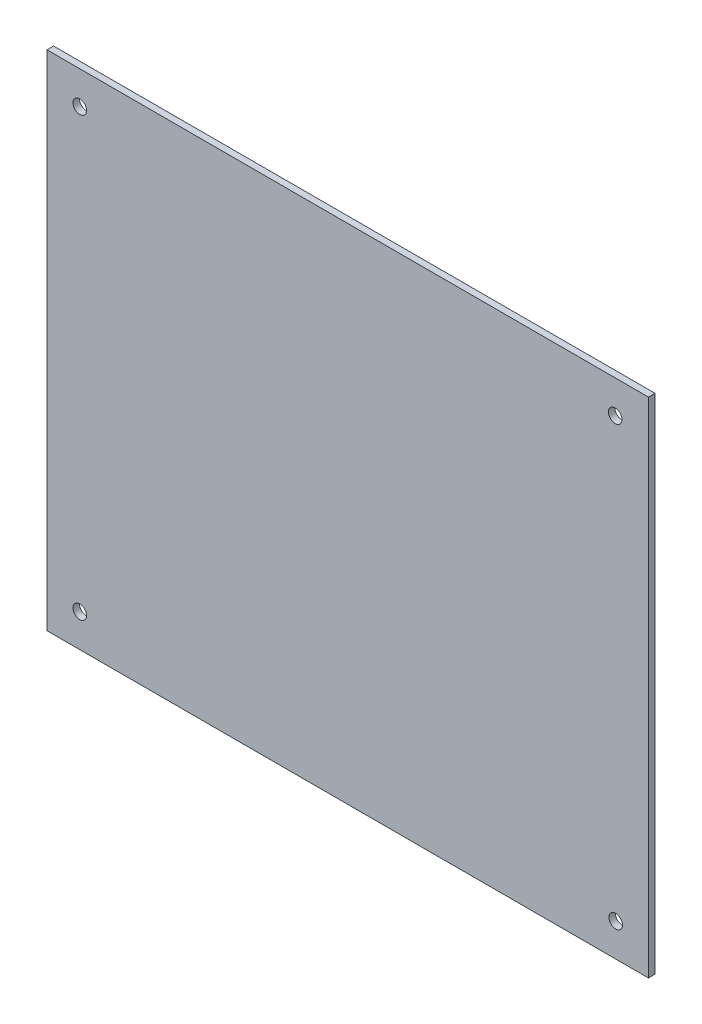
ISO-10303-21;
HEADER;
FILE_DESCRIPTION(('STEP AP214'),'2;1');
FILE_NAME('part.step','',(''),(''),'','','');
FILE_SCHEMA(('AUTOMOTIVE_DESIGN { 1 0 10303 214 1 1 1 1 }'));
ENDSEC;
DATA;
#1=APPLICATION_CONTEXT('core data for automotive mechanical design processes');
#2=APPLICATION_PROTOCOL_DEFINITION('international standard','automotive_design',2000,#1);
#3=PRODUCT_CONTEXT('',#1,'mechanical');
#4=PRODUCT('Part','Part','',(#3));
#5=PRODUCT_RELATED_PRODUCT_CATEGORY('part','',(#4));
#6=PRODUCT_DEFINITION_FORMATION('','',#4);
#7=PRODUCT_DEFINITION_CONTEXT('part definition',#1,'design');
#8=PRODUCT_DEFINITION('design','',#6,#7);
#9=PRODUCT_DEFINITION_SHAPE('','',#8);
#10=(LENGTH_UNIT() NAMED_UNIT(*) SI_UNIT(.MILLI.,.METRE.));
#11=(NAMED_UNIT(*) PLANE_ANGLE_UNIT() SI_UNIT($,.RADIAN.));
#12=(NAMED_UNIT(*) SI_UNIT($,.STERADIAN.) SOLID_ANGLE_UNIT());
#13=UNCERTAINTY_MEASURE_WITH_UNIT(LENGTH_MEASURE(1.E-05),#10,'distance_accuracy_value','');
#14=(GEOMETRIC_REPRESENTATION_CONTEXT(3) GLOBAL_UNCERTAINTY_ASSIGNED_CONTEXT((#13)) GLOBAL_UNIT_ASSIGNED_CONTEXT((#10,
#11,#12)) REPRESENTATION_CONTEXT('',''));
#15=CARTESIAN_POINT('',(0.,0.,0.));
#16=DIRECTION('',(0.,0.,1.));
#17=DIRECTION('',(1.,0.,0.));
#18=AXIS2_PLACEMENT_3D('',#15,#16,#17);
#19=CARTESIAN_POINT('',(0.,0.,3.));
#20=DIRECTION('',(0.,0.,1.));
#21=DIRECTION('',(1.,0.,0.));
#22=AXIS2_PLACEMENT_3D('',#19,#20,#21);
#23=PLANE('',#22);
#24=CARTESIAN_POINT('',(-122.5,-100.,3.));
#25=DIRECTION('',(0.,0.,1.));
#26=DIRECTION('',(1.,0.,0.));
#27=AXIS2_PLACEMENT_3D('',#24,#25,#26);
#28=CIRCLE('',#27,3.1);
#29=CARTESIAN_POINT('',(-119.4,-100.,3.));
#30=VERTEX_POINT('',#29);
#31=EDGE_CURVE('E121',#30,#30,#28,.T.);
#32=ORIENTED_EDGE('',*,*,#31,.F.);
#33=EDGE_LOOP('',(#32));
#34=FACE_BOUND('',#33,.T.);
#35=CARTESIAN_POINT('',(-122.5,100.,3.));
#36=DIRECTION('',(0.,0.,1.));
#37=DIRECTION('',(1.,0.,0.));
#38=AXIS2_PLACEMENT_3D('',#35,#36,#37);
#39=CIRCLE('',#38,3.1);
#40=CARTESIAN_POINT('',(-119.4,100.,3.));
#41=VERTEX_POINT('',#40);
#42=EDGE_CURVE('E100',#41,#41,#39,.T.);
#43=ORIENTED_EDGE('',*,*,#42,.F.);
#44=EDGE_LOOP('',(#43));
#45=FACE_BOUND('',#44,.T.);
#46=DIRECTION('',(0.,1.,0.));
#47=VECTOR('',#46,1.);
#48=CARTESIAN_POINT('',(137.5,115.,3.));
#49=LINE('',#48,#47);
#50=CARTESIAN_POINT('',(137.5,-115.,3.));
#51=VERTEX_POINT('',#50);
#52=CARTESIAN_POINT('',(137.5,115.,3.));
#53=VERTEX_POINT('',#52);
#54=EDGE_CURVE('E85',#51,#53,#49,.T.);
#55=ORIENTED_EDGE('',*,*,#54,.T.);
#56=DIRECTION('',(-1.,0.,0.));
#57=VECTOR('',#56,1.);
#58=CARTESIAN_POINT('',(-137.5,115.,3.));
#59=LINE('',#58,#57);
#60=CARTESIAN_POINT('',(-137.5,115.,3.));
#61=VERTEX_POINT('',#60);
#62=EDGE_CURVE('E80',#53,#61,#59,.T.);
#63=ORIENTED_EDGE('',*,*,#62,.T.);
#64=DIRECTION('',(0.,-1.,0.));
#65=VECTOR('',#64,1.);
#66=CARTESIAN_POINT('',(-137.5,115.,3.));
#67=LINE('',#66,#65);
#68=CARTESIAN_POINT('',(-137.5,-115.,3.));
#69=VERTEX_POINT('',#68);
#70=EDGE_CURVE('E83',#61,#69,#67,.T.);
#71=ORIENTED_EDGE('',*,*,#70,.T.);
#72=DIRECTION('',(1.,0.,0.));
#73=VECTOR('',#72,1.);
#74=CARTESIAN_POINT('',(-137.5,-115.,3.));
#75=LINE('',#74,#73);
#76=EDGE_CURVE('E50',#69,#51,#75,.T.);
#77=ORIENTED_EDGE('',*,*,#76,.T.);
#78=EDGE_LOOP('',(#55,#63,#71,#77));
#79=FACE_BOUND('',#78,.T.);
#80=CARTESIAN_POINT('',(122.275174874517,100.,3.));
#81=DIRECTION('',(0.,0.,1.));
#82=DIRECTION('',(1.,0.,0.));
#83=AXIS2_PLACEMENT_3D('',#80,#81,#82);
#84=CIRCLE('',#83,3.09999999999999);
#85=CARTESIAN_POINT('',(125.375174874517,100.,3.));
#86=VERTEX_POINT('',#85);
#87=EDGE_CURVE('E115',#86,#86,#84,.T.);
#88=ORIENTED_EDGE('',*,*,#87,.F.);
#89=EDGE_LOOP('',(#88));
#90=FACE_BOUND('',#89,.T.);
#91=CARTESIAN_POINT('',(122.500000000001,-99.9999999999971,3.));
#92=DIRECTION('',(0.,0.,1.));
#93=DIRECTION('',(1.,0.,0.));
#94=AXIS2_PLACEMENT_3D('',#91,#92,#93);
#95=CIRCLE('',#94,3.09999999999999);
#96=CARTESIAN_POINT('',(125.600000000001,-99.9999999999971,3.));
#97=VERTEX_POINT('',#96);
#98=EDGE_CURVE('E127',#97,#97,#95,.T.);
#99=ORIENTED_EDGE('',*,*,#98,.F.);
#100=EDGE_LOOP('',(#99));
#101=FACE_BOUND('',#100,.T.);
#102=ADVANCED_FACE('F33',(#34,#45,#79,#90,#101),#23,.T.);
#103=CARTESIAN_POINT('',(0.,0.,0.));
#104=DIRECTION('',(0.,0.,1.));
#105=DIRECTION('',(1.,0.,0.));
#106=AXIS2_PLACEMENT_3D('',#103,#104,#105);
#107=PLANE('',#106);
#108=DIRECTION('',(0.,1.,0.));
#109=VECTOR('',#108,1.);
#110=CARTESIAN_POINT('',(137.5,115.,0.));
#111=LINE('',#110,#109);
#112=CARTESIAN_POINT('',(137.5,-115.,0.));
#113=VERTEX_POINT('',#112);
#114=CARTESIAN_POINT('',(137.5,115.,0.));
#115=VERTEX_POINT('',#114);
#116=EDGE_CURVE('E97',#113,#115,#111,.T.);
#117=ORIENTED_EDGE('',*,*,#116,.F.);
#118=DIRECTION('',(1.,0.,0.));
#119=VECTOR('',#118,1.);
#120=CARTESIAN_POINT('',(-137.5,-115.,0.));
#121=LINE('',#120,#119);
#122=CARTESIAN_POINT('',(-137.5,-115.,0.));
#123=VERTEX_POINT('',#122);
#124=EDGE_CURVE('E73',#123,#113,#121,.T.);
#125=ORIENTED_EDGE('',*,*,#124,.F.);
#126=DIRECTION('',(0.,-1.,0.));
#127=VECTOR('',#126,1.);
#128=CARTESIAN_POINT('',(-137.5,115.,0.));
#129=LINE('',#128,#127);
#130=CARTESIAN_POINT('',(-137.5,115.,0.));
#131=VERTEX_POINT('',#130);
#132=EDGE_CURVE('E67',#131,#123,#129,.T.);
#133=ORIENTED_EDGE('',*,*,#132,.F.);
#134=DIRECTION('',(-1.,0.,0.));
#135=VECTOR('',#134,1.);
#136=CARTESIAN_POINT('',(-137.5,115.,0.));
#137=LINE('',#136,#135);
#138=EDGE_CURVE('E89',#115,#131,#137,.T.);
#139=ORIENTED_EDGE('',*,*,#138,.F.);
#140=EDGE_LOOP('',(#117,#125,#133,#139));
#141=FACE_BOUND('',#140,.T.);
#142=CARTESIAN_POINT('',(-122.5,100.,0.));
#143=DIRECTION('',(0.,0.,1.));
#144=DIRECTION('',(1.,0.,0.));
#145=AXIS2_PLACEMENT_3D('',#142,#143,#144);
#146=CIRCLE('',#145,3.1);
#147=CARTESIAN_POINT('',(-119.4,100.,0.));
#148=VERTEX_POINT('',#147);
#149=EDGE_CURVE('E112',#148,#148,#146,.T.);
#150=ORIENTED_EDGE('',*,*,#149,.T.);
#151=EDGE_LOOP('',(#150));
#152=FACE_BOUND('',#151,.T.);
#153=CARTESIAN_POINT('',(122.275174874517,100.,0.));
#154=DIRECTION('',(0.,0.,1.));
#155=DIRECTION('',(1.,0.,0.));
#156=AXIS2_PLACEMENT_3D('',#153,#154,#155);
#157=CIRCLE('',#156,3.09999999999999);
#158=CARTESIAN_POINT('',(125.375174874517,100.,0.));
#159=VERTEX_POINT('',#158);
#160=EDGE_CURVE('E118',#159,#159,#157,.T.);
#161=ORIENTED_EDGE('',*,*,#160,.T.);
#162=EDGE_LOOP('',(#161));
#163=FACE_BOUND('',#162,.T.);
#164=CARTESIAN_POINT('',(-122.5,-100.,0.));
#165=DIRECTION('',(0.,0.,1.));
#166=DIRECTION('',(1.,0.,0.));
#167=AXIS2_PLACEMENT_3D('',#164,#165,#166);
#168=CIRCLE('',#167,3.1);
#169=CARTESIAN_POINT('',(-119.4,-100.,0.));
#170=VERTEX_POINT('',#169);
#171=EDGE_CURVE('E124',#170,#170,#168,.T.);
#172=ORIENTED_EDGE('',*,*,#171,.T.);
#173=EDGE_LOOP('',(#172));
#174=FACE_BOUND('',#173,.T.);
#175=CARTESIAN_POINT('',(122.500000000001,-99.9999999999971,0.));
#176=DIRECTION('',(0.,0.,1.));
#177=DIRECTION('',(1.,0.,0.));
#178=AXIS2_PLACEMENT_3D('',#175,#176,#177);
#179=CIRCLE('',#178,3.09999999999999);
#180=CARTESIAN_POINT('',(125.600000000001,-99.9999999999971,0.));
#181=VERTEX_POINT('',#180);
#182=EDGE_CURVE('E130',#181,#181,#179,.T.);
#183=ORIENTED_EDGE('',*,*,#182,.T.);
#184=EDGE_LOOP('',(#183));
#185=FACE_BOUND('',#184,.T.);
#186=ADVANCED_FACE('F108',(#141,#152,#163,#174,#185),#107,.F.);
#187=CARTESIAN_POINT('',(137.5,115.,3.));
#188=DIRECTION('',(-1.,0.,0.));
#189=DIRECTION('',(0.,-1.,0.));
#190=AXIS2_PLACEMENT_3D('',#187,#188,#189);
#191=PLANE('',#190);
#192=ORIENTED_EDGE('',*,*,#116,.T.);
#193=DIRECTION('',(0.,0.,-1.));
#194=VECTOR('',#193,1.);
#195=CARTESIAN_POINT('',(137.5,115.,3.));
#196=LINE('',#195,#194);
#197=EDGE_CURVE('E11',#53,#115,#196,.T.);
#198=ORIENTED_EDGE('',*,*,#197,.F.);
#199=ORIENTED_EDGE('',*,*,#54,.F.);
#200=DIRECTION('',(0.,0.,-1.));
#201=VECTOR('',#200,1.);
#202=CARTESIAN_POINT('',(137.5,-115.,3.));
#203=LINE('',#202,#201);
#204=EDGE_CURVE('E93',#51,#113,#203,.T.);
#205=ORIENTED_EDGE('',*,*,#204,.T.);
#206=EDGE_LOOP('',(#192,#198,#199,#205));
#207=FACE_BOUND('',#206,.T.);
#208=ADVANCED_FACE('F35',(#207),#191,.F.);
#209=CARTESIAN_POINT('',(-137.5,115.,3.));
#210=DIRECTION('',(0.,-1.,0.));
#211=DIRECTION('',(0.,0.,-1.));
#212=AXIS2_PLACEMENT_3D('',#209,#210,#211);
#213=PLANE('',#212);
#214=ORIENTED_EDGE('',*,*,#138,.T.);
#215=DIRECTION('',(0.,0.,-1.));
#216=VECTOR('',#215,1.);
#217=CARTESIAN_POINT('',(-137.5,115.,3.));
#218=LINE('',#217,#216);
#219=EDGE_CURVE('E42',#61,#131,#218,.T.);
#220=ORIENTED_EDGE('',*,*,#219,.F.);
#221=ORIENTED_EDGE('',*,*,#62,.F.);
#222=ORIENTED_EDGE('',*,*,#197,.T.);
#223=EDGE_LOOP('',(#214,#220,#221,#222));
#224=FACE_BOUND('',#223,.T.);
#225=ADVANCED_FACE('F88',(#224),#213,.F.);
#226=CARTESIAN_POINT('',(-137.5,115.,3.));
#227=DIRECTION('',(1.,0.,0.));
#228=DIRECTION('',(0.,1.,0.));
#229=AXIS2_PLACEMENT_3D('',#226,#227,#228);
#230=PLANE('',#229);
#231=ORIENTED_EDGE('',*,*,#132,.T.);
#232=DIRECTION('',(0.,0.,-1.));
#233=VECTOR('',#232,1.);
#234=CARTESIAN_POINT('',(-137.5,-115.,3.));
#235=LINE('',#234,#233);
#236=EDGE_CURVE('E90',#69,#123,#235,.T.);
#237=ORIENTED_EDGE('',*,*,#236,.F.);
#238=ORIENTED_EDGE('',*,*,#70,.F.);
#239=ORIENTED_EDGE('',*,*,#219,.T.);
#240=EDGE_LOOP('',(#231,#237,#238,#239));
#241=FACE_BOUND('',#240,.T.);
#242=ADVANCED_FACE('F91',(#241),#230,.F.);
#243=CARTESIAN_POINT('',(-137.5,-115.,3.));
#244=DIRECTION('',(0.,1.,0.));
#245=DIRECTION('',(0.,0.,1.));
#246=AXIS2_PLACEMENT_3D('',#243,#244,#245);
#247=PLANE('',#246);
#248=ORIENTED_EDGE('',*,*,#124,.T.);
#249=ORIENTED_EDGE('',*,*,#204,.F.);
#250=ORIENTED_EDGE('',*,*,#76,.F.);
#251=ORIENTED_EDGE('',*,*,#236,.T.);
#252=EDGE_LOOP('',(#248,#249,#250,#251));
#253=FACE_BOUND('',#252,.T.);
#254=ADVANCED_FACE('F105',(#253),#247,.F.);
#255=CARTESIAN_POINT('',(-122.5,100.,3.));
#256=DIRECTION('',(0.,0.,-1.));
#257=DIRECTION('',(-1.,0.,0.));
#258=AXIS2_PLACEMENT_3D('',#255,#256,#257);
#259=CYLINDRICAL_SURFACE('',#258,3.1);
#260=ORIENTED_EDGE('',*,*,#42,.T.);
#261=EDGE_LOOP('',(#260));
#262=FACE_BOUND('',#261,.T.);
#263=ORIENTED_EDGE('',*,*,#149,.F.);
#264=EDGE_LOOP('',(#263));
#265=FACE_BOUND('',#264,.T.);
#266=ADVANCED_FACE('F149',(#262,#265),#259,.F.);
#267=CARTESIAN_POINT('',(122.275174874517,100.,3.));
#268=DIRECTION('',(0.,0.,-1.));
#269=DIRECTION('',(-1.,0.,0.));
#270=AXIS2_PLACEMENT_3D('',#267,#268,#269);
#271=CYLINDRICAL_SURFACE('',#270,3.09999999999999);
#272=ORIENTED_EDGE('',*,*,#87,.T.);
#273=EDGE_LOOP('',(#272));
#274=FACE_BOUND('',#273,.T.);
#275=ORIENTED_EDGE('',*,*,#160,.F.);
#276=EDGE_LOOP('',(#275));
#277=FACE_BOUND('',#276,.T.);
#278=ADVANCED_FACE('F195',(#274,#277),#271,.F.);
#279=CARTESIAN_POINT('',(-122.5,-100.,3.));
#280=DIRECTION('',(0.,0.,-1.));
#281=DIRECTION('',(-1.,0.,0.));
#282=AXIS2_PLACEMENT_3D('',#279,#280,#281);
#283=CYLINDRICAL_SURFACE('',#282,3.1);
#284=ORIENTED_EDGE('',*,*,#31,.T.);
#285=EDGE_LOOP('',(#284));
#286=FACE_BOUND('',#285,.T.);
#287=ORIENTED_EDGE('',*,*,#171,.F.);
#288=EDGE_LOOP('',(#287));
#289=FACE_BOUND('',#288,.T.);
#290=ADVANCED_FACE('F203',(#286,#289),#283,.F.);
#291=CARTESIAN_POINT('',(122.500000000001,-99.9999999999971,3.));
#292=DIRECTION('',(0.,0.,-1.));
#293=DIRECTION('',(-1.,0.,0.));
#294=AXIS2_PLACEMENT_3D('',#291,#292,#293);
#295=CYLINDRICAL_SURFACE('',#294,3.09999999999999);
#296=ORIENTED_EDGE('',*,*,#98,.T.);
#297=EDGE_LOOP('',(#296));
#298=FACE_BOUND('',#297,.T.);
#299=ORIENTED_EDGE('',*,*,#182,.F.);
#300=EDGE_LOOP('',(#299));
#301=FACE_BOUND('',#300,.T.);
#302=ADVANCED_FACE('F136',(#298,#301),#295,.F.);
#303=CLOSED_SHELL('',(#102,#186,#208,#225,#242,#254,#266,#278,#290,#302));
#304=MANIFOLD_SOLID_BREP('B2',#303);
#305=ADVANCED_BREP_SHAPE_REPRESENTATION('',(#18,#304),#14);
#306=SHAPE_DEFINITION_REPRESENTATION(#9,#305);
ENDSEC;
END-ISO-10303-21;
